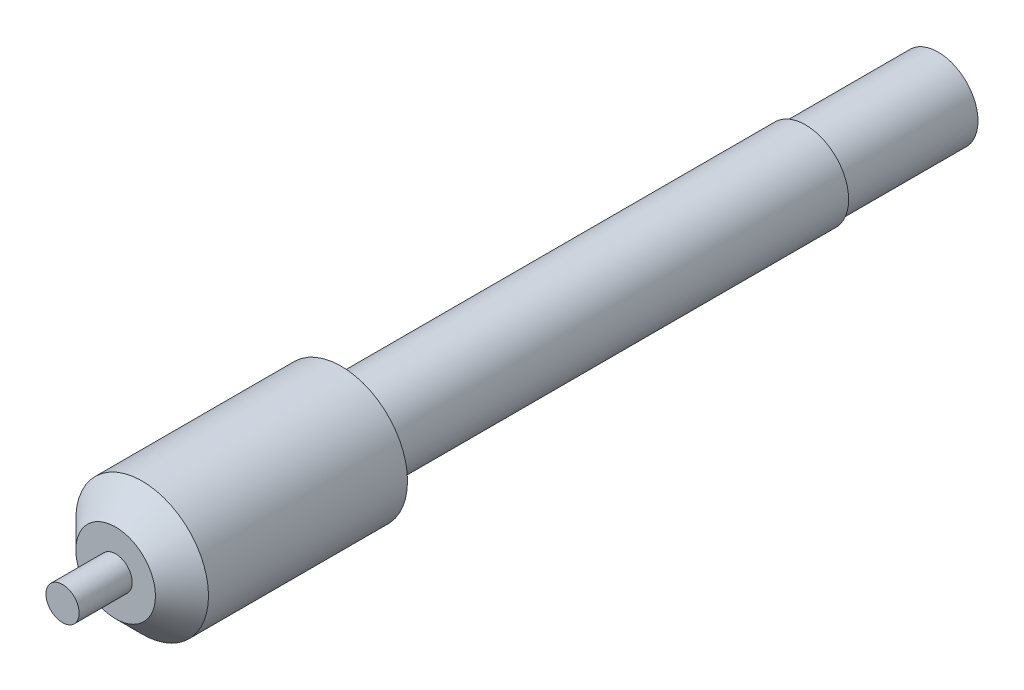
ISO-10303-21;
HEADER;
FILE_DESCRIPTION(('STEP AP214'),'2;1');
FILE_NAME('part.step','',(''),(''),'','','');
FILE_SCHEMA(('AUTOMOTIVE_DESIGN { 1 0 10303 214 1 1 1 1 }'));
ENDSEC;
DATA;
#1=APPLICATION_CONTEXT('core data for automotive mechanical design processes');
#2=APPLICATION_PROTOCOL_DEFINITION('international standard','automotive_design',2000,#1);
#3=PRODUCT_CONTEXT('',#1,'mechanical');
#4=PRODUCT('Part','Part','',(#3));
#5=PRODUCT_RELATED_PRODUCT_CATEGORY('part','',(#4));
#6=PRODUCT_DEFINITION_FORMATION('','',#4);
#7=PRODUCT_DEFINITION_CONTEXT('part definition',#1,'design');
#8=PRODUCT_DEFINITION('design','',#6,#7);
#9=PRODUCT_DEFINITION_SHAPE('','',#8);
#10=(LENGTH_UNIT() NAMED_UNIT(*) SI_UNIT(.MILLI.,.METRE.));
#11=(NAMED_UNIT(*) PLANE_ANGLE_UNIT() SI_UNIT($,.RADIAN.));
#12=(NAMED_UNIT(*) SI_UNIT($,.STERADIAN.) SOLID_ANGLE_UNIT());
#13=UNCERTAINTY_MEASURE_WITH_UNIT(LENGTH_MEASURE(1.E-05),#10,'distance_accuracy_value','');
#14=(GEOMETRIC_REPRESENTATION_CONTEXT(3) GLOBAL_UNCERTAINTY_ASSIGNED_CONTEXT((#13)) GLOBAL_UNIT_ASSIGNED_CONTEXT((#10,
#11,#12)) REPRESENTATION_CONTEXT('',''));
#15=CARTESIAN_POINT('',(0.,0.,0.));
#16=DIRECTION('',(0.,0.,1.));
#17=DIRECTION('',(1.,0.,0.));
#18=AXIS2_PLACEMENT_3D('',#15,#16,#17);
#19=CARTESIAN_POINT('',(0.,0.,62.));
#20=DIRECTION('',(0.,0.,1.));
#21=DIRECTION('',(1.,0.,0.));
#22=AXIS2_PLACEMENT_3D('',#19,#20,#21);
#23=PLANE('',#22);
#24=CARTESIAN_POINT('',(0.,0.,62.));
#25=DIRECTION('',(0.,0.,1.));
#26=DIRECTION('',(1.,0.,0.));
#27=AXIS2_PLACEMENT_3D('',#24,#25,#26);
#28=CIRCLE('',#27,3.00000000000001);
#29=CARTESIAN_POINT('',(3.00000000000001,0.,62.));
#30=VERTEX_POINT('',#29);
#31=EDGE_CURVE('E37',#30,#30,#28,.T.);
#32=ORIENTED_EDGE('',*,*,#31,.T.);
#33=EDGE_LOOP('',(#32));
#34=FACE_BOUND('',#33,.T.);
#35=CARTESIAN_POINT('',(0.,0.,62.));
#36=DIRECTION('',(0.,0.,1.));
#37=DIRECTION('',(1.,0.,0.));
#38=AXIS2_PLACEMENT_3D('',#35,#36,#37);
#39=CIRCLE('',#38,1.25);
#40=CARTESIAN_POINT('',(1.25,0.,62.));
#41=VERTEX_POINT('',#40);
#42=EDGE_CURVE('E60',#41,#41,#39,.T.);
#43=ORIENTED_EDGE('',*,*,#42,.F.);
#44=EDGE_LOOP('',(#43));
#45=FACE_BOUND('',#44,.T.);
#46=ADVANCED_FACE('F30',(#34,#45),#23,.T.);
#47=CARTESIAN_POINT('',(0.,0.,10.));
#48=DIRECTION('',(0.,0.,-1.));
#49=DIRECTION('',(-1.,0.,0.));
#50=AXIS2_PLACEMENT_3D('',#47,#48,#49);
#51=CYLINDRICAL_SURFACE('',#50,3.);
#52=CARTESIAN_POINT('',(0.,0.,10.));
#53=DIRECTION('',(0.,0.,1.));
#54=DIRECTION('',(1.,0.,0.));
#55=AXIS2_PLACEMENT_3D('',#52,#53,#54);
#56=CIRCLE('',#55,3.);
#57=CARTESIAN_POINT('',(3.,0.,10.));
#58=VERTEX_POINT('',#57);
#59=EDGE_CURVE('E41',#58,#58,#56,.T.);
#60=ORIENTED_EDGE('',*,*,#59,.F.);
#61=EDGE_LOOP('',(#60));
#62=FACE_BOUND('',#61,.T.);
#63=CARTESIAN_POINT('',(0.,0.,0.));
#64=DIRECTION('',(0.,0.,1.));
#65=DIRECTION('',(1.,0.,0.));
#66=AXIS2_PLACEMENT_3D('',#63,#64,#65);
#67=CIRCLE('',#66,3.);
#68=CARTESIAN_POINT('',(3.,0.,0.));
#69=VERTEX_POINT('',#68);
#70=EDGE_CURVE('E45',#69,#69,#67,.T.);
#71=ORIENTED_EDGE('',*,*,#70,.T.);
#72=EDGE_LOOP('',(#71));
#73=FACE_BOUND('',#72,.T.);
#74=ADVANCED_FACE('F75',(#62,#73),#51,.T.);
#75=CARTESIAN_POINT('',(0.,0.,0.));
#76=DIRECTION('',(0.,0.,1.));
#77=DIRECTION('',(1.,0.,0.));
#78=AXIS2_PLACEMENT_3D('',#75,#76,#77);
#79=PLANE('',#78);
#80=ORIENTED_EDGE('',*,*,#70,.F.);
#81=EDGE_LOOP('',(#80));
#82=FACE_BOUND('',#81,.T.);
#83=ADVANCED_FACE('F80',(#82),#79,.F.);
#84=CARTESIAN_POINT('',(0.,0.,10.));
#85=DIRECTION('',(0.,0.,1.));
#86=DIRECTION('',(1.,0.,0.));
#87=AXIS2_PLACEMENT_3D('',#84,#85,#86);
#88=PLANE('',#87);
#89=CARTESIAN_POINT('',(0.,0.,10.));
#90=DIRECTION('',(0.,0.,1.));
#91=DIRECTION('',(1.,0.,0.));
#92=AXIS2_PLACEMENT_3D('',#89,#90,#91);
#93=CIRCLE('',#92,3.25);
#94=CARTESIAN_POINT('',(3.25,0.,10.));
#95=VERTEX_POINT('',#94);
#96=EDGE_CURVE('E51',#95,#95,#93,.T.);
#97=ORIENTED_EDGE('',*,*,#96,.F.);
#98=EDGE_LOOP('',(#97));
#99=FACE_BOUND('',#98,.T.);
#100=ORIENTED_EDGE('',*,*,#59,.T.);
#101=EDGE_LOOP('',(#100));
#102=FACE_BOUND('',#101,.T.);
#103=ADVANCED_FACE('F92',(#99,#102),#88,.F.);
#104=CARTESIAN_POINT('',(0.,0.,45.));
#105=DIRECTION('',(0.,0.,-1.));
#106=DIRECTION('',(-1.,0.,0.));
#107=AXIS2_PLACEMENT_3D('',#104,#105,#106);
#108=CYLINDRICAL_SURFACE('',#107,3.25);
#109=CARTESIAN_POINT('',(0.,0.,45.));
#110=DIRECTION('',(0.,0.,1.));
#111=DIRECTION('',(1.,0.,0.));
#112=AXIS2_PLACEMENT_3D('',#109,#110,#111);
#113=CIRCLE('',#112,3.25);
#114=CARTESIAN_POINT('',(3.25,0.,45.));
#115=VERTEX_POINT('',#114);
#116=EDGE_CURVE('E49',#115,#115,#113,.T.);
#117=ORIENTED_EDGE('',*,*,#116,.F.);
#118=EDGE_LOOP('',(#117));
#119=FACE_BOUND('',#118,.T.);
#120=ORIENTED_EDGE('',*,*,#96,.T.);
#121=EDGE_LOOP('',(#120));
#122=FACE_BOUND('',#121,.T.);
#123=ADVANCED_FACE('F88',(#119,#122),#108,.T.);
#124=CARTESIAN_POINT('',(0.,0.,45.));
#125=DIRECTION('',(0.,0.,1.));
#126=DIRECTION('',(1.,0.,0.));
#127=AXIS2_PLACEMENT_3D('',#124,#125,#126);
#128=PLANE('',#127);
#129=CARTESIAN_POINT('',(0.,0.,45.));
#130=DIRECTION('',(0.,0.,1.));
#131=DIRECTION('',(1.,0.,0.));
#132=AXIS2_PLACEMENT_3D('',#129,#130,#131);
#133=CIRCLE('',#132,5.);
#134=CARTESIAN_POINT('',(5.,0.,45.));
#135=VERTEX_POINT('',#134);
#136=EDGE_CURVE('E54',#135,#135,#133,.T.);
#137=ORIENTED_EDGE('',*,*,#136,.F.);
#138=EDGE_LOOP('',(#137));
#139=FACE_BOUND('',#138,.T.);
#140=ORIENTED_EDGE('',*,*,#116,.T.);
#141=EDGE_LOOP('',(#140));
#142=FACE_BOUND('',#141,.T.);
#143=ADVANCED_FACE('F84',(#139,#142),#128,.F.);
#144=CARTESIAN_POINT('',(0.,0.,62.));
#145=DIRECTION('',(0.,0.,-1.));
#146=DIRECTION('',(-1.,0.,0.));
#147=AXIS2_PLACEMENT_3D('',#144,#145,#146);
#148=CYLINDRICAL_SURFACE('',#147,5.);
#149=CARTESIAN_POINT('',(0.,0.,60.));
#150=DIRECTION('',(0.,0.,1.));
#151=DIRECTION('',(1.,0.,0.));
#152=AXIS2_PLACEMENT_3D('',#149,#150,#151);
#153=CIRCLE('',#152,5.);
#154=CARTESIAN_POINT('',(5.,0.,60.));
#155=VERTEX_POINT('',#154);
#156=EDGE_CURVE('E10',#155,#155,#153,.F.);
#157=ORIENTED_EDGE('',*,*,#156,.T.);
#158=EDGE_LOOP('',(#157));
#159=FACE_BOUND('',#158,.T.);
#160=ORIENTED_EDGE('',*,*,#136,.T.);
#161=EDGE_LOOP('',(#160));
#162=FACE_BOUND('',#161,.T.);
#163=ADVANCED_FACE('F87',(#159,#162),#148,.T.);
#164=CARTESIAN_POINT('',(0.,0.,62.));
#165=DIRECTION('',(0.,0.,-1.));
#166=DIRECTION('',(-1.,0.,0.));
#167=AXIS2_PLACEMENT_3D('',#164,#165,#166);
#168=CONICAL_SURFACE('',#167,3.00000000000001,0.785398163397444);
#169=ORIENTED_EDGE('',*,*,#156,.F.);
#170=EDGE_LOOP('',(#169));
#171=FACE_BOUND('',#170,.T.);
#172=ORIENTED_EDGE('',*,*,#31,.F.);
#173=EDGE_LOOP('',(#172));
#174=FACE_BOUND('',#173,.T.);
#175=ADVANCED_FACE('F32',(#171,#174),#168,.T.);
#176=CARTESIAN_POINT('',(0.,0.,66.));
#177=DIRECTION('',(0.,0.,-1.));
#178=DIRECTION('',(-1.,0.,0.));
#179=AXIS2_PLACEMENT_3D('',#176,#177,#178);
#180=CYLINDRICAL_SURFACE('',#179,1.25);
#181=CARTESIAN_POINT('',(0.,0.,66.));
#182=DIRECTION('',(0.,0.,1.));
#183=DIRECTION('',(1.,0.,0.));
#184=AXIS2_PLACEMENT_3D('',#181,#182,#183);
#185=CIRCLE('',#184,1.25);
#186=CARTESIAN_POINT('',(1.25,0.,66.));
#187=VERTEX_POINT('',#186);
#188=EDGE_CURVE('E59',#187,#187,#185,.T.);
#189=ORIENTED_EDGE('',*,*,#188,.F.);
#190=EDGE_LOOP('',(#189));
#191=FACE_BOUND('',#190,.T.);
#192=ORIENTED_EDGE('',*,*,#42,.T.);
#193=EDGE_LOOP('',(#192));
#194=FACE_BOUND('',#193,.T.);
#195=ADVANCED_FACE('F68',(#191,#194),#180,.T.);
#196=CARTESIAN_POINT('',(0.,0.,66.));
#197=DIRECTION('',(0.,0.,1.));
#198=DIRECTION('',(1.,0.,0.));
#199=AXIS2_PLACEMENT_3D('',#196,#197,#198);
#200=PLANE('',#199);
#201=ORIENTED_EDGE('',*,*,#188,.T.);
#202=EDGE_LOOP('',(#201));
#203=FACE_BOUND('',#202,.T.);
#204=ADVANCED_FACE('F66',(#203),#200,.T.);
#205=CLOSED_SHELL('',(#46,#74,#83,#103,#123,#143,#163,#175,#195,#204));
#206=MANIFOLD_SOLID_BREP('B2',#205);
#207=ADVANCED_BREP_SHAPE_REPRESENTATION('',(#18,#206),#14);
#208=SHAPE_DEFINITION_REPRESENTATION(#9,#207);
ENDSEC;
END-ISO-10303-21;
